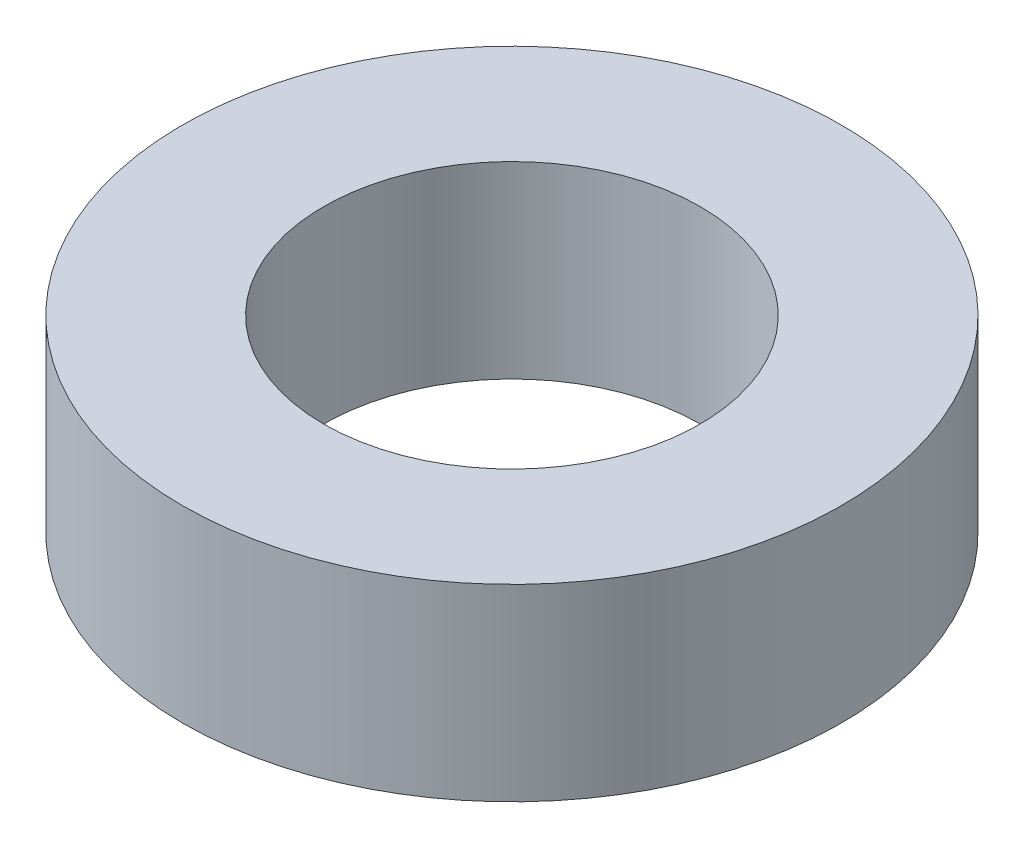
ISO-10303-21;
HEADER;
FILE_DESCRIPTION(('STEP AP214'),'2;1');
FILE_NAME('part.step','',(''),(''),'','','');
FILE_SCHEMA(('AUTOMOTIVE_DESIGN { 1 0 10303 214 1 1 1 1 }'));
ENDSEC;
DATA;
#1=APPLICATION_CONTEXT('core data for automotive mechanical design processes');
#2=APPLICATION_PROTOCOL_DEFINITION('international standard','automotive_design',2000,#1);
#3=PRODUCT_CONTEXT('',#1,'mechanical');
#4=PRODUCT('Part','Part','',(#3));
#5=PRODUCT_RELATED_PRODUCT_CATEGORY('part','',(#4));
#6=PRODUCT_DEFINITION_FORMATION('','',#4);
#7=PRODUCT_DEFINITION_CONTEXT('part definition',#1,'design');
#8=PRODUCT_DEFINITION('design','',#6,#7);
#9=PRODUCT_DEFINITION_SHAPE('','',#8);
#10=(LENGTH_UNIT() NAMED_UNIT(*) SI_UNIT(.MILLI.,.METRE.));
#11=(NAMED_UNIT(*) PLANE_ANGLE_UNIT() SI_UNIT($,.RADIAN.));
#12=(NAMED_UNIT(*) SI_UNIT($,.STERADIAN.) SOLID_ANGLE_UNIT());
#13=UNCERTAINTY_MEASURE_WITH_UNIT(LENGTH_MEASURE(1.E-05),#10,'distance_accuracy_value','');
#14=(GEOMETRIC_REPRESENTATION_CONTEXT(3) GLOBAL_UNCERTAINTY_ASSIGNED_CONTEXT((#13)) GLOBAL_UNIT_ASSIGNED_CONTEXT((#10,
#11,#12)) REPRESENTATION_CONTEXT('',''));
#15=CARTESIAN_POINT('',(0.,0.,0.));
#16=DIRECTION('',(0.,0.,1.));
#17=DIRECTION('',(1.,0.,0.));
#18=AXIS2_PLACEMENT_3D('',#15,#16,#17);
#19=CARTESIAN_POINT('',(0.,4.,0.));
#20=DIRECTION('',(0.,1.,0.));
#21=DIRECTION('',(0.,0.,1.));
#22=AXIS2_PLACEMENT_3D('',#19,#20,#21);
#23=PLANE('',#22);
#24=CARTESIAN_POINT('',(0.,4.,0.));
#25=DIRECTION('',(0.,1.,0.));
#26=DIRECTION('',(0.,0.,1.));
#27=AXIS2_PLACEMENT_3D('',#24,#25,#26);
#28=CIRCLE('',#27,7.);
#29=CARTESIAN_POINT('',(0.,4.,7.));
#30=VERTEX_POINT('',#29);
#31=EDGE_CURVE('E10',#30,#30,#28,.T.);
#32=ORIENTED_EDGE('',*,*,#31,.T.);
#33=EDGE_LOOP('',(#32));
#34=FACE_BOUND('',#33,.T.);
#35=CARTESIAN_POINT('',(0.,4.,0.));
#36=DIRECTION('',(0.,1.,0.));
#37=DIRECTION('',(0.,0.,1.));
#38=AXIS2_PLACEMENT_3D('',#35,#36,#37);
#39=CIRCLE('',#38,4.);
#40=CARTESIAN_POINT('',(0.,4.,4.));
#41=VERTEX_POINT('',#40);
#42=EDGE_CURVE('E56',#41,#41,#39,.T.);
#43=ORIENTED_EDGE('',*,*,#42,.F.);
#44=EDGE_LOOP('',(#43));
#45=FACE_BOUND('',#44,.T.);
#46=ADVANCED_FACE('F43',(#34,#45),#23,.T.);
#47=CARTESIAN_POINT('',(0.,0.,0.));
#48=DIRECTION('',(0.,1.,0.));
#49=DIRECTION('',(0.,0.,1.));
#50=AXIS2_PLACEMENT_3D('',#47,#48,#49);
#51=PLANE('',#50);
#52=CARTESIAN_POINT('',(0.,0.,0.));
#53=DIRECTION('',(0.,1.,0.));
#54=DIRECTION('',(0.,0.,1.));
#55=AXIS2_PLACEMENT_3D('',#52,#53,#54);
#56=CIRCLE('',#55,7.);
#57=CARTESIAN_POINT('',(0.,0.,7.));
#58=VERTEX_POINT('',#57);
#59=EDGE_CURVE('E47',#58,#58,#56,.T.);
#60=ORIENTED_EDGE('',*,*,#59,.F.);
#61=EDGE_LOOP('',(#60));
#62=FACE_BOUND('',#61,.T.);
#63=CARTESIAN_POINT('',(0.,0.,0.));
#64=DIRECTION('',(0.,1.,0.));
#65=DIRECTION('',(0.,0.,1.));
#66=AXIS2_PLACEMENT_3D('',#63,#64,#65);
#67=CIRCLE('',#66,4.);
#68=CARTESIAN_POINT('',(0.,0.,4.));
#69=VERTEX_POINT('',#68);
#70=EDGE_CURVE('E58',#69,#69,#67,.T.);
#71=ORIENTED_EDGE('',*,*,#70,.T.);
#72=EDGE_LOOP('',(#71));
#73=FACE_BOUND('',#72,.T.);
#74=ADVANCED_FACE('F70',(#62,#73),#51,.F.);
#75=CARTESIAN_POINT('',(0.,4.,0.));
#76=DIRECTION('',(0.,-1.,0.));
#77=DIRECTION('',(0.,0.,-1.));
#78=AXIS2_PLACEMENT_3D('',#75,#76,#77);
#79=CYLINDRICAL_SURFACE('',#78,7.);
#80=ORIENTED_EDGE('',*,*,#31,.F.);
#81=EDGE_LOOP('',(#80));
#82=FACE_BOUND('',#81,.T.);
#83=ORIENTED_EDGE('',*,*,#59,.T.);
#84=EDGE_LOOP('',(#83));
#85=FACE_BOUND('',#84,.T.);
#86=ADVANCED_FACE('F45',(#82,#85),#79,.T.);
#87=CARTESIAN_POINT('',(0.,4.,0.));
#88=DIRECTION('',(0.,-1.,0.));
#89=DIRECTION('',(0.,0.,-1.));
#90=AXIS2_PLACEMENT_3D('',#87,#88,#89);
#91=CYLINDRICAL_SURFACE('',#90,4.);
#92=ORIENTED_EDGE('',*,*,#42,.T.);
#93=EDGE_LOOP('',(#92));
#94=FACE_BOUND('',#93,.T.);
#95=ORIENTED_EDGE('',*,*,#70,.F.);
#96=EDGE_LOOP('',(#95));
#97=FACE_BOUND('',#96,.T.);
#98=ADVANCED_FACE('F66',(#94,#97),#91,.F.);
#99=CLOSED_SHELL('',(#46,#74,#86,#98));
#100=MANIFOLD_SOLID_BREP('B2',#99);
#101=ADVANCED_BREP_SHAPE_REPRESENTATION('',(#18,#100),#14);
#102=SHAPE_DEFINITION_REPRESENTATION(#9,#101);
ENDSEC;
END-ISO-10303-21;
